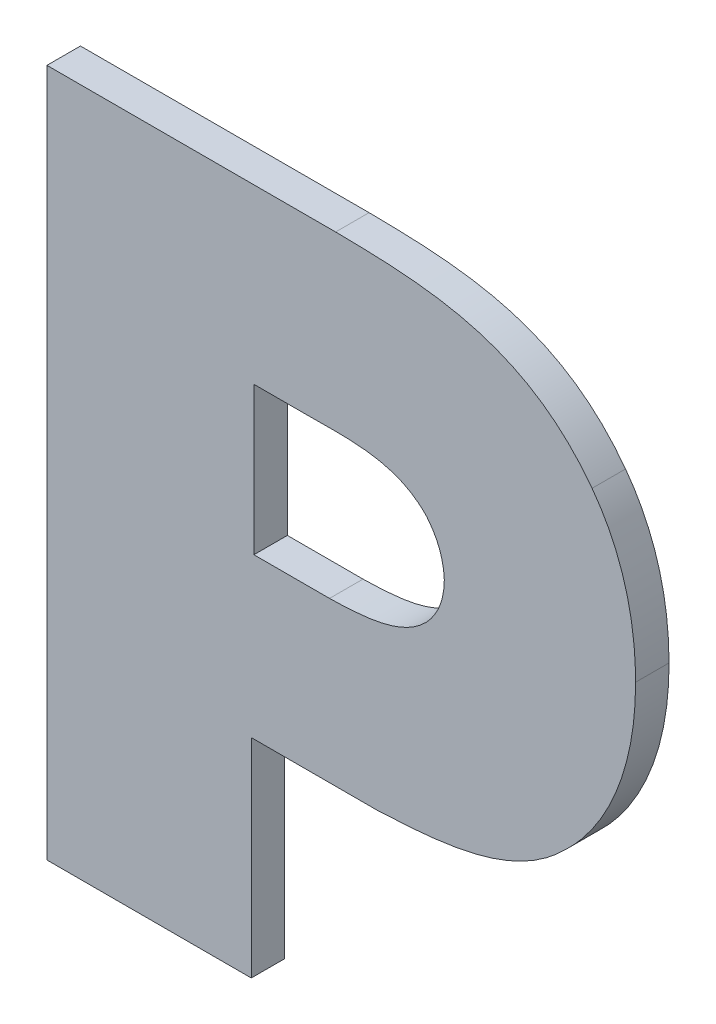
ISO-10303-21;
HEADER;
FILE_DESCRIPTION(('STEP AP214'),'2;1');
FILE_NAME('part.step','',(''),(''),'','','');
FILE_SCHEMA(('AUTOMOTIVE_DESIGN { 1 0 10303 214 1 1 1 1 }'));
ENDSEC;
DATA;
#1=APPLICATION_CONTEXT('core data for automotive mechanical design processes');
#2=APPLICATION_PROTOCOL_DEFINITION('international standard','automotive_design',2000,#1);
#3=PRODUCT_CONTEXT('',#1,'mechanical');
#4=PRODUCT('Part','Part','',(#3));
#5=PRODUCT_RELATED_PRODUCT_CATEGORY('part','',(#4));
#6=PRODUCT_DEFINITION_FORMATION('','',#4);
#7=PRODUCT_DEFINITION_CONTEXT('part definition',#1,'design');
#8=PRODUCT_DEFINITION('design','',#6,#7);
#9=PRODUCT_DEFINITION_SHAPE('','',#8);
#10=(LENGTH_UNIT() NAMED_UNIT(*) SI_UNIT(.MILLI.,.METRE.));
#11=(NAMED_UNIT(*) PLANE_ANGLE_UNIT() SI_UNIT($,.RADIAN.));
#12=(NAMED_UNIT(*) SI_UNIT($,.STERADIAN.) SOLID_ANGLE_UNIT());
#13=UNCERTAINTY_MEASURE_WITH_UNIT(LENGTH_MEASURE(1.E-05),#10,'distance_accuracy_value','');
#14=(GEOMETRIC_REPRESENTATION_CONTEXT(3) GLOBAL_UNCERTAINTY_ASSIGNED_CONTEXT((#13)) GLOBAL_UNIT_ASSIGNED_CONTEXT((#10,
#11,#12)) REPRESENTATION_CONTEXT('',''));
#15=CARTESIAN_POINT('',(0.,0.,0.));
#16=DIRECTION('',(0.,0.,1.));
#17=DIRECTION('',(1.,0.,0.));
#18=AXIS2_PLACEMENT_3D('',#15,#16,#17);
#19=CARTESIAN_POINT('',(-0.0967378041936285,-0.174241422626017,0.));
#20=CARTESIAN_POINT('',(-0.0968257015815132,-0.171889093901459,0.));
#21=CARTESIAN_POINT('',(-0.0982965922124445,-0.170133986594017,0.));
#22=CARTESIAN_POINT('',(-0.0967378041936285,-0.174241422626017,0.003));
#23=CARTESIAN_POINT('',(-0.0968257015815132,-0.171889093901459,0.003));
#24=CARTESIAN_POINT('',(-0.0982965922124445,-0.170133986594017,0.003));
#25=(BOUNDED_SURFACE() B_SPLINE_SURFACE(1,2,((#19,#20,#21),(#22,#23,#24)),.UNSPECIFIED.,.F.,.F.,
.F.) B_SPLINE_SURFACE_WITH_KNOTS((2,2),(3,3),(0.,0.0605498423726523),(-3.28337692066341,
-3.03707587900119),
.UNSPECIFIED.) GEOMETRIC_REPRESENTATION_ITEM() RATIONAL_B_SPLINE_SURFACE(((1.,0.992426553478269,
1.),(1.,0.992426553478269,1.))) REPRESENTATION_ITEM('') SURFACE());
#26=CARTESIAN_POINT('',(-0.142651936646498,-0.191678351140562,0.));
#27=DIRECTION('',(0.,0.,-1.));
#28=DIRECTION('',(-0.915373470419152,-0.402605774490131,0.));
#29=AXIS2_PLACEMENT_3D('',#26,#27,#28);
#30=ELLIPSE('',#29,0.0495459588736265,0.0178614282231468);
#31=CARTESIAN_POINT('',(-0.0982965922124445,-0.170133986594017,0.));
#32=VERTEX_POINT('',#31);
#33=CARTESIAN_POINT('',(-0.0967378041936284,-0.174241422626017,0.));
#34=VERTEX_POINT('',#33);
#35=EDGE_CURVE('E11',#32,#34,#30,.T.);
#36=DIRECTION('',(0.,0.,1.));
#37=VECTOR('',#36,1.);
#38=CARTESIAN_POINT('',(-0.0967378041936284,-0.174241422626017,0.));
#39=LINE('',#38,#37);
#40=CARTESIAN_POINT('',(-0.0967378041936284,-0.174241422626017,0.003));
#41=VERTEX_POINT('',#40);
#42=EDGE_CURVE('E26',#34,#41,#39,.T.);
#43=CARTESIAN_POINT('',(-0.142651936646498,-0.191678351140562,0.003));
#44=DIRECTION('',(0.,0.,-1.));
#45=DIRECTION('',(-0.915373470419152,-0.402605774490131,0.));
#46=AXIS2_PLACEMENT_3D('',#43,#44,#45);
#47=ELLIPSE('',#46,0.0495459588736265,0.0178614282231468);
#48=CARTESIAN_POINT('',(-0.0982965922124445,-0.170133986594017,0.003));
#49=VERTEX_POINT('',#48);
#50=EDGE_CURVE('E424',#49,#41,#47,.T.);
#51=DIRECTION('',(0.,0.,1.));
#52=VECTOR('',#51,1.);
#53=CARTESIAN_POINT('',(-0.0982965922124445,-0.170133986594017,0.));
#54=LINE('',#53,#52);
#55=EDGE_CURVE('E418',#32,#49,#54,.T.);
#56=ORIENTED_EDGE('',*,*,#35,.T.);
#57=ORIENTED_EDGE('',*,*,#42,.T.);
#58=ORIENTED_EDGE('',*,*,#50,.F.);
#59=ORIENTED_EDGE('',*,*,#55,.F.);
#60=EDGE_LOOP('',(#56,#57,#58,#59));
#61=FACE_BOUND('',#60,.T.);
#62=ADVANCED_FACE('F17',(#61),#25,.T.);
#63=CARTESIAN_POINT('',(-0.108740550557404,-0.16758533323252,0.));
#64=CARTESIAN_POINT('',(-0.108740550557404,-0.16758533323252,0.003));
#65=CARTESIAN_POINT('',(-0.105233258695452,-0.167585358431592,0.));
#66=CARTESIAN_POINT('',(-0.105233258695452,-0.167585358431592,0.003));
#67=CARTESIAN_POINT('',(-0.1009465620805,-0.167258010157494,0.));
#68=CARTESIAN_POINT('',(-0.1009465620805,-0.167258010157494,0.003));
#69=CARTESIAN_POINT('',(-0.0982965922124445,-0.170133986594017,0.));
#70=CARTESIAN_POINT('',(-0.0982965922124445,-0.170133986594017,0.003));
#71=B_SPLINE_SURFACE_WITH_KNOTS('',3,1,((#63,#64),(#65,#66),(#67,#68),(#69,#70)),.UNSPECIFIED.,
.F.,.F.,.F.,(4,4),(2,2),(0.,1.),(0.,0.0003),.UNSPECIFIED.);
#72=CARTESIAN_POINT('',(-0.108740550557404,-0.16758533323252,0.));
#73=CARTESIAN_POINT('',(-0.105233258695452,-0.167585358431592,0.));
#74=CARTESIAN_POINT('',(-0.1009465620805,-0.167258010157494,0.));
#75=CARTESIAN_POINT('',(-0.0982965922124445,-0.170133986594017,0.));
#76=B_SPLINE_CURVE_WITH_KNOTS('',3,(#72,#73,#74,#75),.UNSPECIFIED.,.F.,.F.,(4,4),(0.,1.),.UNSPECIFIED.);
#77=CARTESIAN_POINT('',(-0.108740550557404,-0.16758533323252,0.));
#78=VERTEX_POINT('',#77);
#79=EDGE_CURVE('E410',#78,#32,#76,.T.);
#80=CARTESIAN_POINT('',(-0.108740550557404,-0.16758533323252,0.003));
#81=CARTESIAN_POINT('',(-0.105233258695452,-0.167585358431592,0.003));
#82=CARTESIAN_POINT('',(-0.1009465620805,-0.167258010157494,0.003));
#83=CARTESIAN_POINT('',(-0.0982965922124445,-0.170133986594017,0.003));
#84=B_SPLINE_CURVE_WITH_KNOTS('',3,(#80,#81,#82,#83),.UNSPECIFIED.,.F.,.F.,(4,4),(0.,1.),.UNSPECIFIED.);
#85=CARTESIAN_POINT('',(-0.108740550557404,-0.16758533323252,0.003));
#86=VERTEX_POINT('',#85);
#87=EDGE_CURVE('E405',#86,#49,#84,.T.);
#88=DIRECTION('',(0.,0.,1.));
#89=VECTOR('',#88,1.);
#90=CARTESIAN_POINT('',(-0.108740550557404,-0.16758533323252,0.));
#91=LINE('',#90,#89);
#92=EDGE_CURVE('E402',#78,#86,#91,.T.);
#93=ORIENTED_EDGE('',*,*,#79,.T.);
#94=ORIENTED_EDGE('',*,*,#55,.T.);
#95=ORIENTED_EDGE('',*,*,#87,.F.);
#96=ORIENTED_EDGE('',*,*,#92,.F.);
#97=EDGE_LOOP('',(#93,#94,#95,#96));
#98=FACE_BOUND('',#97,.T.);
#99=ADVANCED_FACE('F443',(#98),#71,.T.);
#100=CARTESIAN_POINT('',(-0.113806661089584,-0.16758533323252,0.));
#101=DIRECTION('',(0.,-1.,0.));
#102=DIRECTION('',(1.,0.,0.));
#103=AXIS2_PLACEMENT_3D('',#100,#101,#102);
#104=PLANE('',#103);
#105=DIRECTION('',(1.,0.,0.));
#106=VECTOR('',#105,1.);
#107=CARTESIAN_POINT('',(-0.113806661089584,-0.16758533323252,0.));
#108=LINE('',#107,#106);
#109=CARTESIAN_POINT('',(-0.113806661089584,-0.16758533323252,0.));
#110=VERTEX_POINT('',#109);
#111=EDGE_CURVE('E399',#110,#78,#108,.T.);
#112=ORIENTED_EDGE('',*,*,#111,.T.);
#113=ORIENTED_EDGE('',*,*,#92,.T.);
#114=DIRECTION('',(1.,0.,0.));
#115=VECTOR('',#114,1.);
#116=CARTESIAN_POINT('',(-0.113806661089584,-0.16758533323252,0.003));
#117=LINE('',#116,#115);
#118=CARTESIAN_POINT('',(-0.113806661089584,-0.16758533323252,0.003));
#119=VERTEX_POINT('',#118);
#120=EDGE_CURVE('E396',#119,#86,#117,.T.);
#121=ORIENTED_EDGE('',*,*,#120,.F.);
#122=DIRECTION('',(0.,0.,1.));
#123=VECTOR('',#122,1.);
#124=CARTESIAN_POINT('',(-0.113806661089584,-0.16758533323252,0.));
#125=LINE('',#124,#123);
#126=EDGE_CURVE('E393',#110,#119,#125,.T.);
#127=ORIENTED_EDGE('',*,*,#126,.F.);
#128=EDGE_LOOP('',(#112,#113,#121,#127));
#129=FACE_BOUND('',#128,.T.);
#130=ADVANCED_FACE('F440',(#129),#104,.T.);
#131=CARTESIAN_POINT('',(-0.113806661089584,-0.180819534913461,0.));
#132=DIRECTION('',(1.,0.,0.));
#133=DIRECTION('',(0.,1.,0.));
#134=AXIS2_PLACEMENT_3D('',#131,#132,#133);
#135=PLANE('',#134);
#136=DIRECTION('',(0.,1.,0.));
#137=VECTOR('',#136,1.);
#138=CARTESIAN_POINT('',(-0.113806661089584,-0.180819534913461,0.));
#139=LINE('',#138,#137);
#140=CARTESIAN_POINT('',(-0.113806661089584,-0.180819534913461,0.));
#141=VERTEX_POINT('',#140);
#142=EDGE_CURVE('E390',#141,#110,#139,.T.);
#143=ORIENTED_EDGE('',*,*,#142,.T.);
#144=ORIENTED_EDGE('',*,*,#126,.T.);
#145=DIRECTION('',(0.,1.,0.));
#146=VECTOR('',#145,1.);
#147=CARTESIAN_POINT('',(-0.113806661089584,-0.180819534913461,0.003));
#148=LINE('',#147,#146);
#149=CARTESIAN_POINT('',(-0.113806661089584,-0.180819534913461,0.003));
#150=VERTEX_POINT('',#149);
#151=EDGE_CURVE('E387',#150,#119,#148,.T.);
#152=ORIENTED_EDGE('',*,*,#151,.F.);
#153=DIRECTION('',(0.,0.,1.));
#154=VECTOR('',#153,1.);
#155=CARTESIAN_POINT('',(-0.113806661089584,-0.180819534913461,0.));
#156=LINE('',#155,#154);
#157=EDGE_CURVE('E384',#141,#150,#156,.T.);
#158=ORIENTED_EDGE('',*,*,#157,.F.);
#159=EDGE_LOOP('',(#143,#144,#152,#158));
#160=FACE_BOUND('',#159,.T.);
#161=ADVANCED_FACE('F437',(#160),#135,.T.);
#162=CARTESIAN_POINT('',(-0.107025872505436,-0.180819534913461,0.));
#163=DIRECTION('',(0.,1.,0.));
#164=DIRECTION('',(-1.,0.,0.));
#165=AXIS2_PLACEMENT_3D('',#162,#163,#164);
#166=PLANE('',#165);
#167=DIRECTION('',(-1.,0.,0.));
#168=VECTOR('',#167,1.);
#169=CARTESIAN_POINT('',(-0.107025872505436,-0.180819534913461,0.));
#170=LINE('',#169,#168);
#171=CARTESIAN_POINT('',(-0.107025872505436,-0.180819534913461,0.));
#172=VERTEX_POINT('',#171);
#173=EDGE_CURVE('E381',#172,#141,#170,.T.);
#174=ORIENTED_EDGE('',*,*,#173,.T.);
#175=ORIENTED_EDGE('',*,*,#157,.T.);
#176=DIRECTION('',(-1.,0.,0.));
#177=VECTOR('',#176,1.);
#178=CARTESIAN_POINT('',(-0.107025872505436,-0.180819534913461,0.003));
#179=LINE('',#178,#177);
#180=CARTESIAN_POINT('',(-0.107025872505436,-0.180819534913461,0.003));
#181=VERTEX_POINT('',#180);
#182=EDGE_CURVE('E378',#181,#150,#179,.T.);
#183=ORIENTED_EDGE('',*,*,#182,.F.);
#184=DIRECTION('',(0.,0.,1.));
#185=VECTOR('',#184,1.);
#186=CARTESIAN_POINT('',(-0.107025872505436,-0.180819534913461,0.));
#187=LINE('',#186,#185);
#188=EDGE_CURVE('E372',#172,#181,#187,.T.);
#189=ORIENTED_EDGE('',*,*,#188,.F.);
#190=EDGE_LOOP('',(#174,#175,#183,#189));
#191=FACE_BOUND('',#190,.T.);
#192=ADVANCED_FACE('F434',(#191),#166,.T.);
#193=CARTESIAN_POINT('',(-0.0983745372290203,-0.178356645672117,0.));
#194=CARTESIAN_POINT('',(-0.0983745372290203,-0.178356645672117,0.003));
#195=CARTESIAN_POINT('',(-0.100556863987455,-0.180577928894314,0.));
#196=CARTESIAN_POINT('',(-0.100556863987455,-0.180577928894314,0.003));
#197=CARTESIAN_POINT('',(-0.103986225439683,-0.180741605941563,0.));
#198=CARTESIAN_POINT('',(-0.103986225439683,-0.180741605941563,0.003));
#199=CARTESIAN_POINT('',(-0.107025872505436,-0.180819534913461,0.));
#200=CARTESIAN_POINT('',(-0.107025872505436,-0.180819534913461,0.003));
#201=B_SPLINE_SURFACE_WITH_KNOTS('',3,1,((#193,#194),(#195,#196),(#197,#198),(#199,#200)),
.UNSPECIFIED.,.F.,.F.,.F.,(4,4),(2,2),(0.,1.),(0.,0.0003),.UNSPECIFIED.);
#202=CARTESIAN_POINT('',(-0.0983745372290203,-0.178356645672117,0.));
#203=CARTESIAN_POINT('',(-0.100556863987455,-0.180577928894314,0.));
#204=CARTESIAN_POINT('',(-0.103986225439683,-0.180741605941563,0.));
#205=CARTESIAN_POINT('',(-0.107025872505436,-0.180819534913461,0.));
#206=B_SPLINE_CURVE_WITH_KNOTS('',3,(#202,#203,#204,#205),.UNSPECIFIED.,.F.,.F.,(4,4),(0.,1.),.UNSPECIFIED.);
#207=CARTESIAN_POINT('',(-0.0983745372290203,-0.178356645672117,0.));
#208=VERTEX_POINT('',#207);
#209=EDGE_CURVE('E364',#208,#172,#206,.T.);
#210=CARTESIAN_POINT('',(-0.0983745372290203,-0.178356645672117,0.003));
#211=CARTESIAN_POINT('',(-0.100556863987455,-0.180577928894314,0.003));
#212=CARTESIAN_POINT('',(-0.103986225439683,-0.180741605941563,0.003));
#213=CARTESIAN_POINT('',(-0.107025872505436,-0.180819534913461,0.003));
#214=B_SPLINE_CURVE_WITH_KNOTS('',3,(#210,#211,#212,#213),.UNSPECIFIED.,.F.,.F.,(4,4),(0.,1.),.UNSPECIFIED.);
#215=CARTESIAN_POINT('',(-0.0983745372290203,-0.178356645672117,0.003));
#216=VERTEX_POINT('',#215);
#217=EDGE_CURVE('E359',#216,#181,#214,.T.);
#218=DIRECTION('',(0.,0.,1.));
#219=VECTOR('',#218,1.);
#220=CARTESIAN_POINT('',(-0.0983745372290203,-0.178356645672117,0.));
#221=LINE('',#220,#219);
#222=EDGE_CURVE('E356',#208,#216,#221,.T.);
#223=ORIENTED_EDGE('',*,*,#209,.T.);
#224=ORIENTED_EDGE('',*,*,#188,.T.);
#225=ORIENTED_EDGE('',*,*,#217,.F.);
#226=ORIENTED_EDGE('',*,*,#222,.F.);
#227=EDGE_LOOP('',(#223,#224,#225,#226));
#228=FACE_BOUND('',#227,.T.);
#229=ADVANCED_FACE('F431',(#228),#201,.T.);
#230=CARTESIAN_POINT('',(-0.0983745372290204,-0.178356645672117,0.));
#231=CARTESIAN_POINT('',(-0.096737469001351,-0.176642684990442,0.));
#232=CARTESIAN_POINT('',(-0.0967378041936284,-0.174241422626017,0.));
#233=CARTESIAN_POINT('',(-0.0983745372290204,-0.178356645672117,0.003));
#234=CARTESIAN_POINT('',(-0.096737469001351,-0.176642684990442,0.003));
#235=CARTESIAN_POINT('',(-0.0967378041936284,-0.174241422626017,0.003));
#236=(BOUNDED_SURFACE() B_SPLINE_SURFACE(1,2,((#230,#231,#232),(#233,#234,#235)),.UNSPECIFIED.,
.F.,.F.,.F.) B_SPLINE_SURFACE_WITH_KNOTS((2,2),(3,3),(0.,0.131295742859842),(-3.32565261163516,
-2.93267418086353),
.UNSPECIFIED.) GEOMETRIC_REPRESENTATION_ITEM() RATIONAL_B_SPLINE_SURFACE(((1.,0.980758021685967,
1.),(1.,0.980758021685967,1.))) REPRESENTATION_ITEM('') SURFACE());
#237=CARTESIAN_POINT('',(-0.118217977262407,-0.167626220694398,0.));
#238=DIRECTION('',(0.,0.,-1.));
#239=DIRECTION('',(-0.919658977595631,0.392717920303822,0.));
#240=AXIS2_PLACEMENT_3D('',#237,#238,#239);
#241=ELLIPSE('',#240,0.0228491795290156,0.011339904751575);
#242=EDGE_CURVE('E353',#34,#208,#241,.T.);
#243=CARTESIAN_POINT('',(-0.118217977262407,-0.167626220694398,0.003));
#244=DIRECTION('',(0.,0.,-1.));
#245=DIRECTION('',(-0.919658977595631,0.392717920303822,0.));
#246=AXIS2_PLACEMENT_3D('',#243,#244,#245);
#247=ELLIPSE('',#246,0.0228491795290156,0.011339904751575);
#248=EDGE_CURVE('E350',#41,#216,#247,.T.);
#249=ORIENTED_EDGE('',*,*,#242,.T.);
#250=ORIENTED_EDGE('',*,*,#222,.T.);
#251=ORIENTED_EDGE('',*,*,#248,.F.);
#252=ORIENTED_EDGE('',*,*,#42,.F.);
#253=EDGE_LOOP('',(#249,#250,#251,#252));
#254=FACE_BOUND('',#253,.T.);
#255=ADVANCED_FACE('F428',(#254),#236,.T.);
#256=CARTESIAN_POINT('',(-0.13235635029142,-0.213795935346145,0.));
#257=DIRECTION('',(0.,-1.,0.));
#258=DIRECTION('',(1.,0.,0.));
#259=AXIS2_PLACEMENT_3D('',#256,#257,#258);
#260=PLANE('',#259);
#261=DIRECTION('',(1.,0.,0.));
#262=VECTOR('',#261,1.);
#263=CARTESIAN_POINT('',(-0.13235635029142,-0.213795935346145,0.));
#264=LINE('',#263,#262);
#265=CARTESIAN_POINT('',(-0.13235635029142,-0.213795935346145,0.));
#266=VERTEX_POINT('',#265);
#267=CARTESIAN_POINT('',(-0.114040469398147,-0.213795935346145,0.));
#268=VERTEX_POINT('',#267);
#269=EDGE_CURVE('E348',#266,#268,#264,.T.);
#270=ORIENTED_EDGE('',*,*,#269,.T.);
#271=DIRECTION('',(0.,0.,1.));
#272=VECTOR('',#271,1.);
#273=CARTESIAN_POINT('',(-0.114040469398147,-0.213795935346145,0.));
#274=LINE('',#273,#272);
#275=CARTESIAN_POINT('',(-0.114040469398147,-0.213795935346145,0.003));
#276=VERTEX_POINT('',#275);
#277=EDGE_CURVE('E346',#268,#276,#274,.T.);
#278=ORIENTED_EDGE('',*,*,#277,.T.);
#279=DIRECTION('',(1.,0.,0.));
#280=VECTOR('',#279,1.);
#281=CARTESIAN_POINT('',(-0.13235635029142,-0.213795935346145,0.003));
#282=LINE('',#281,#280);
#283=CARTESIAN_POINT('',(-0.13235635029142,-0.213795935346145,0.003));
#284=VERTEX_POINT('',#283);
#285=EDGE_CURVE('E153',#284,#276,#282,.T.);
#286=ORIENTED_EDGE('',*,*,#285,.F.);
#287=DIRECTION('',(0.,0.,1.));
#288=VECTOR('',#287,1.);
#289=CARTESIAN_POINT('',(-0.13235635029142,-0.213795935346145,0.));
#290=LINE('',#289,#288);
#291=EDGE_CURVE('E342',#266,#284,#290,.T.);
#292=ORIENTED_EDGE('',*,*,#291,.F.);
#293=EDGE_LOOP('',(#270,#278,#286,#292));
#294=FACE_BOUND('',#293,.T.);
#295=ADVANCED_FACE('F481',(#294),#260,.T.);
#296=CARTESIAN_POINT('',(-0.13235635029142,-0.152098684228321,0.));
#297=DIRECTION('',(-1.,0.,0.));
#298=DIRECTION('',(0.,-1.,0.));
#299=AXIS2_PLACEMENT_3D('',#296,#297,#298);
#300=PLANE('',#299);
#301=DIRECTION('',(0.,-1.,0.));
#302=VECTOR('',#301,1.);
#303=CARTESIAN_POINT('',(-0.13235635029142,-0.152098684228321,0.));
#304=LINE('',#303,#302);
#305=CARTESIAN_POINT('',(-0.13235635029142,-0.152098684228321,0.));
#306=VERTEX_POINT('',#305);
#307=EDGE_CURVE('E339',#306,#266,#304,.T.);
#308=ORIENTED_EDGE('',*,*,#307,.T.);
#309=ORIENTED_EDGE('',*,*,#291,.T.);
#310=DIRECTION('',(0.,-1.,0.));
#311=VECTOR('',#310,1.);
#312=CARTESIAN_POINT('',(-0.13235635029142,-0.152098684228321,0.003));
#313=LINE('',#312,#311);
#314=CARTESIAN_POINT('',(-0.13235635029142,-0.152098684228321,0.003));
#315=VERTEX_POINT('',#314);
#316=EDGE_CURVE('E337',#315,#284,#313,.T.);
#317=ORIENTED_EDGE('',*,*,#316,.F.);
#318=DIRECTION('',(0.,0.,1.));
#319=VECTOR('',#318,1.);
#320=CARTESIAN_POINT('',(-0.13235635029142,-0.152098684228321,0.));
#321=LINE('',#320,#319);
#322=EDGE_CURVE('E334',#306,#315,#321,.T.);
#323=ORIENTED_EDGE('',*,*,#322,.F.);
#324=EDGE_LOOP('',(#308,#309,#317,#323));
#325=FACE_BOUND('',#324,.T.);
#326=ADVANCED_FACE('F489',(#325),#300,.T.);
#327=CARTESIAN_POINT('',(-0.106480294826928,-0.152098684228321,0.));
#328=DIRECTION('',(0.,1.,0.));
#329=DIRECTION('',(-1.,0.,0.));
#330=AXIS2_PLACEMENT_3D('',#327,#328,#329);
#331=PLANE('',#330);
#332=DIRECTION('',(-1.,0.,0.));
#333=VECTOR('',#332,1.);
#334=CARTESIAN_POINT('',(-0.106480294826928,-0.152098684228321,0.));
#335=LINE('',#334,#333);
#336=CARTESIAN_POINT('',(-0.106480294826928,-0.152098684228321,0.));
#337=VERTEX_POINT('',#336);
#338=EDGE_CURVE('E331',#337,#306,#335,.T.);
#339=ORIENTED_EDGE('',*,*,#338,.T.);
#340=ORIENTED_EDGE('',*,*,#322,.T.);
#341=DIRECTION('',(-1.,0.,0.));
#342=VECTOR('',#341,1.);
#343=CARTESIAN_POINT('',(-0.106480294826928,-0.152098684228321,0.003));
#344=LINE('',#343,#342);
#345=CARTESIAN_POINT('',(-0.106480294826928,-0.152098684228321,0.003));
#346=VERTEX_POINT('',#345);
#347=EDGE_CURVE('E328',#346,#315,#344,.T.);
#348=ORIENTED_EDGE('',*,*,#347,.F.);
#349=DIRECTION('',(0.,0.,1.));
#350=VECTOR('',#349,1.);
#351=CARTESIAN_POINT('',(-0.106480294826928,-0.152098684228321,0.));
#352=LINE('',#351,#350);
#353=EDGE_CURVE('E325',#337,#346,#352,.T.);
#354=ORIENTED_EDGE('',*,*,#353,.F.);
#355=EDGE_LOOP('',(#339,#340,#348,#354));
#356=FACE_BOUND('',#355,.T.);
#357=ADVANCED_FACE('F493',(#356),#331,.T.);
#358=CARTESIAN_POINT('',(-0.0834880070915036,-0.160500599730184,0.));
#359=CARTESIAN_POINT('',(-0.0834880070915036,-0.160500599730184,0.003));
#360=CARTESIAN_POINT('',(-0.0893335196636609,-0.152652049176437,0.));
#361=CARTESIAN_POINT('',(-0.0893335196636609,-0.152652049176437,0.003));
#362=CARTESIAN_POINT('',(-0.097751030579984,-0.152192198055002,0.));
#363=CARTESIAN_POINT('',(-0.097751030579984,-0.152192198055002,0.003));
#364=CARTESIAN_POINT('',(-0.106480294826928,-0.152098684228321,0.));
#365=CARTESIAN_POINT('',(-0.106480294826928,-0.152098684228321,0.003));
#366=B_SPLINE_SURFACE_WITH_KNOTS('',3,1,((#358,#359),(#360,#361),(#362,#363),(#364,#365)),
.UNSPECIFIED.,.F.,.F.,.F.,(4,4),(2,2),(0.,1.),(0.,0.0003),.UNSPECIFIED.);
#367=CARTESIAN_POINT('',(-0.0834880070915036,-0.160500599730184,0.));
#368=CARTESIAN_POINT('',(-0.0893335196636609,-0.152652049176437,0.));
#369=CARTESIAN_POINT('',(-0.097751030579984,-0.152192198055002,0.));
#370=CARTESIAN_POINT('',(-0.106480294826928,-0.152098684228321,0.));
#371=B_SPLINE_CURVE_WITH_KNOTS('',3,(#367,#368,#369,#370),.UNSPECIFIED.,.F.,.F.,(4,4),(0.,1.),.UNSPECIFIED.);
#372=CARTESIAN_POINT('',(-0.0834880070915036,-0.160500599730184,0.));
#373=VERTEX_POINT('',#372);
#374=EDGE_CURVE('E291',#373,#337,#371,.T.);
#375=CARTESIAN_POINT('',(-0.0834880070915036,-0.160500599730184,0.003));
#376=CARTESIAN_POINT('',(-0.0893335196636609,-0.152652049176437,0.003));
#377=CARTESIAN_POINT('',(-0.097751030579984,-0.152192198055002,0.003));
#378=CARTESIAN_POINT('',(-0.106480294826928,-0.152098684228321,0.003));
#379=B_SPLINE_CURVE_WITH_KNOTS('',3,(#375,#376,#377,#378),.UNSPECIFIED.,.F.,.F.,(4,4),(0.,1.),.UNSPECIFIED.);
#380=CARTESIAN_POINT('',(-0.0834880070915036,-0.160500599730184,0.003));
#381=VERTEX_POINT('',#380);
#382=EDGE_CURVE('E308',#381,#346,#379,.T.);
#383=DIRECTION('',(0.,0.,1.));
#384=VECTOR('',#383,1.);
#385=CARTESIAN_POINT('',(-0.0834880070915036,-0.160500599730184,0.));
#386=LINE('',#385,#384);
#387=EDGE_CURVE('E293',#373,#381,#386,.T.);
#388=ORIENTED_EDGE('',*,*,#374,.T.);
#389=ORIENTED_EDGE('',*,*,#353,.T.);
#390=ORIENTED_EDGE('',*,*,#382,.F.);
#391=ORIENTED_EDGE('',*,*,#387,.F.);
#392=EDGE_LOOP('',(#388,#389,#390,#391));
#393=FACE_BOUND('',#392,.T.);
#394=ADVANCED_FACE('F496',(#393),#366,.T.);
#395=CARTESIAN_POINT('',(-0.0795910290221276,-0.173610102220341,0.));
#396=CARTESIAN_POINT('',(-0.0795911810120428,-0.165755607112078,0.));
#397=CARTESIAN_POINT('',(-0.0834880070915036,-0.160500599730184,0.));
#398=CARTESIAN_POINT('',(-0.0795910290221276,-0.173610102220341,0.003));
#399=CARTESIAN_POINT('',(-0.0795911810120428,-0.165755607112078,0.003));
#400=CARTESIAN_POINT('',(-0.0834880070915036,-0.160500599730184,0.003));
#401=(BOUNDED_SURFACE() B_SPLINE_SURFACE(1,2,((#395,#396,#397),(#398,#399,#400)),.UNSPECIFIED.,
.F.,.F.,.F.) B_SPLINE_SURFACE_WITH_KNOTS((2,2),(3,3),(0.,0.0287431762030417),
(-0.306992221891992,-0.0064354486976359),
.UNSPECIFIED.) GEOMETRIC_REPRESENTATION_ITEM() RATIONAL_B_SPLINE_SURFACE(((1.,0.988729438048959,
1.),(1.,0.988729438048959,1.))) REPRESENTATION_ITEM('') SURFACE());
#402=CARTESIAN_POINT('',(-0.0795910290221276,-0.173610102220341,0.));
#403=CARTESIAN_POINT('',(-0.0795910378746284,-0.173289206997902,0.));
#404=CARTESIAN_POINT('',(-0.0795960316046132,-0.172968292037768,0.));
#405=CARTESIAN_POINT('',(-0.0796163790223154,-0.17233205838337,0.));
#406=CARTESIAN_POINT('',(-0.0796315616039234,-0.172016734157963,0.));
#407=CARTESIAN_POINT('',(-0.0796723122289031,-0.171391862234799,0.));
#408=CARTESIAN_POINT('',(-0.0796977086244951,-0.171082303474623,0.));
#409=CARTESIAN_POINT('',(-0.0797589042115397,-0.17046915253469,0.));
#410=CARTESIAN_POINT('',(-0.0797945326072473,-0.170165543392426,0.));
#411=CARTESIAN_POINT('',(-0.0798761961675504,-0.169564472292133,0.));
#412=CARTESIAN_POINT('',(-0.0799220630158278,-0.169266987561039,0.));
#413=CARTESIAN_POINT('',(-0.0800241951768409,-0.168678340841473,0.));
#414=CARTESIAN_POINT('',(-0.0800802963898668,-0.168387150470413,0.));
#415=CARTESIAN_POINT('',(-0.0802028762106454,-0.167811261185297,0.));
#416=CARTESIAN_POINT('',(-0.0802691967716995,-0.167526528716167,0.));
#417=CARTESIAN_POINT('',(-0.0804121814596128,-0.166963716911774,0.));
#418=CARTESIAN_POINT('',(-0.0804886954739031,-0.166685599519141,0.));
#419=CARTESIAN_POINT('',(-0.080652020460211,-0.166136171888199,0.));
#420=CARTESIAN_POINT('',(-0.0807386911217503,-0.165864820012281,0.));
#421=CARTESIAN_POINT('',(-0.0809222701041933,-0.165329069271403,0.));
#422=CARTESIAN_POINT('',(-0.0810190497022285,-0.165064626361013,0.));
#423=CARTESIAN_POINT('',(-0.0812227748018691,-0.164542830754143,0.));
#424=CARTESIAN_POINT('',(-0.0813296047955142,-0.164285433011895,0.));
#425=CARTESIAN_POINT('',(-0.0815533466337949,-0.16377785575727,0.));
#426=CARTESIAN_POINT('',(-0.0816701575793477,-0.163527631809478,0.));
#427=CARTESIAN_POINT('',(-0.0819137659063232,-0.163034520827849,0.));
#428=CARTESIAN_POINT('',(-0.0820404780795577,-0.162791591729548,0.));
#429=CARTESIAN_POINT('',(-0.0823037806606822,-0.162313178507681,0.));
#430=CARTESIAN_POINT('',(-0.0824403022779158,-0.162077656543779,0.));
#431=CARTESIAN_POINT('',(-0.0827231104958188,-0.161614158348455,0.));
#432=CARTESIAN_POINT('',(-0.0828693449932229,-0.161386150339278,0.));
#433=CARTESIAN_POINT('',(-0.0831714349089739,-0.160937760220683,0.));
#434=CARTESIAN_POINT('',(-0.0833272548607435,-0.160717354212594,0.));
#435=CARTESIAN_POINT('',(-0.0834880070915036,-0.160500599730184,0.));
#436=B_SPLINE_CURVE_WITH_KNOTS('',3,(#402,#403,#404,#405,#406,#407,#408,#409,#410,#411,#412,
#413,#414,#415,#416,#417,#418,#419,#420,#421,#422,#423,#424,#425,#426,#427,#428,#429,#430,#431,
#432,#433,#434,#435),.UNSPECIFIED.,.F.,.F.,(4,2,2,2,2,2,2,2,2,2,2,2,2,2,2,2,4),(0.,
0.000962675939883551,0.0019095768295927,0.00284118852499832,0.00375807313893125,
0.00466086941839039,0.00555029235204594,0.00642713189596271,0.0072922507122064,
0.00814658082930227,0.00899111915643842,0.00982692181526395,0.0106550972936832,
0.0114767984736574,0.0122932136370127,0.0131055566058743,0.0139150562231228),.UNSPECIFIED.);
#437=CARTESIAN_POINT('',(-0.0795910290221276,-0.173610102220341,0.));
#438=VERTEX_POINT('',#437);
#439=EDGE_CURVE('E286',#438,#373,#436,.T.);
#440=CARTESIAN_POINT('',(-0.0834880070915036,-0.160500599730184,0.003));
#441=CARTESIAN_POINT('',(-0.0795911810120428,-0.165755607112078,0.003));
#442=CARTESIAN_POINT('',(-0.0795910290221276,-0.173610102220341,0.003));
#443=(BOUNDED_CURVE() B_SPLINE_CURVE(2,(#440,#441,#442),.UNSPECIFIED.,.F.,
.F.) B_SPLINE_CURVE_WITH_KNOTS((3,3),(-0.306992221891992,-0.0064354486976359),
.UNSPECIFIED.) CURVE() GEOMETRIC_REPRESENTATION_ITEM() RATIONAL_B_SPLINE_CURVE((1.,
0.988729438048959,1.)) REPRESENTATION_ITEM(''));
#444=CARTESIAN_POINT('',(-0.0795910290221276,-0.173610102220341,0.003));
#445=VERTEX_POINT('',#444);
#446=EDGE_CURVE('E236',#445,#381,#443,.F.);
#447=DIRECTION('',(0.,0.,1.));
#448=VECTOR('',#447,1.);
#449=CARTESIAN_POINT('',(-0.0795910290221276,-0.173610102220341,0.));
#450=LINE('',#449,#448);
#451=EDGE_CURVE('E234',#438,#445,#450,.T.);
#452=ORIENTED_EDGE('',*,*,#439,.T.);
#453=ORIENTED_EDGE('',*,*,#387,.T.);
#454=ORIENTED_EDGE('',*,*,#446,.F.);
#455=ORIENTED_EDGE('',*,*,#451,.F.);
#456=EDGE_LOOP('',(#452,#453,#454,#455));
#457=FACE_BOUND('',#456,.T.);
#458=ADVANCED_FACE('F202',(#457),#401,.F.);
#459=CARTESIAN_POINT('',(-0.0859041421586396,-0.189774841849129,0.));
#460=CARTESIAN_POINT('',(-0.079550477444554,-0.183759567175503,0.));
#461=CARTESIAN_POINT('',(-0.0795910290221276,-0.173610102220341,0.));
#462=CARTESIAN_POINT('',(-0.0859041421586396,-0.189774841849129,0.003));
#463=CARTESIAN_POINT('',(-0.079550477444554,-0.183759567175503,0.003));
#464=CARTESIAN_POINT('',(-0.0795910290221276,-0.173610102220341,0.003));
#465=(BOUNDED_SURFACE() B_SPLINE_SURFACE(1,2,((#459,#460,#461),(#462,#463,#464)),.UNSPECIFIED.,
.F.,.F.,.F.) B_SPLINE_SURFACE_WITH_KNOTS((2,2),(3,3),(0.,0.118644741901312),(0.272864371694586,
1.06550640205632),.UNSPECIFIED.) GEOMETRIC_REPRESENTATION_ITEM() RATIONAL_B_SPLINE_SURFACE(((1.,
0.922487421700011,1.),(1.,0.922487421700011,1.))) REPRESENTATION_ITEM('') SURFACE());
#466=CARTESIAN_POINT('',(-0.0859041421586396,-0.189774841849129,0.));
#467=CARTESIAN_POINT('',(-0.079550477444554,-0.183759567175503,0.));
#468=CARTESIAN_POINT('',(-0.0795910290221276,-0.173610102220341,0.));
#469=(BOUNDED_CURVE() B_SPLINE_CURVE(2,(#466,#467,#468),.UNSPECIFIED.,.F.,
.F.) B_SPLINE_CURVE_WITH_KNOTS((3,3),(0.272864371694586,1.06550640205632),
.UNSPECIFIED.) CURVE() GEOMETRIC_REPRESENTATION_ITEM() RATIONAL_B_SPLINE_CURVE((1.,
0.922487421700011,1.)) REPRESENTATION_ITEM(''));
#470=CARTESIAN_POINT('',(-0.0859041421586396,-0.189774841849129,0.));
#471=VERTEX_POINT('',#470);
#472=EDGE_CURVE('E231',#471,#438,#469,.T.);
#473=CARTESIAN_POINT('',(-0.0795910290221276,-0.173610102220341,0.003));
#474=CARTESIAN_POINT('',(-0.079550477444554,-0.183759567175503,0.003));
#475=CARTESIAN_POINT('',(-0.0859041421586396,-0.189774841849129,0.003));
#476=(BOUNDED_CURVE() B_SPLINE_CURVE(2,(#473,#474,#475),.UNSPECIFIED.,.F.,
.F.) B_SPLINE_CURVE_WITH_KNOTS((3,3),(0.272864371694586,1.06550640205632),
.UNSPECIFIED.) CURVE() GEOMETRIC_REPRESENTATION_ITEM() RATIONAL_B_SPLINE_CURVE((1.,
0.922487421700011,1.)) REPRESENTATION_ITEM(''));
#477=CARTESIAN_POINT('',(-0.0859041421586396,-0.189774841849129,0.003));
#478=VERTEX_POINT('',#477);
#479=EDGE_CURVE('E182',#478,#445,#476,.F.);
#480=DIRECTION('',(0.,0.,1.));
#481=VECTOR('',#480,1.);
#482=CARTESIAN_POINT('',(-0.0859041421586396,-0.189774841849129,0.));
#483=LINE('',#482,#481);
#484=EDGE_CURVE('E178',#471,#478,#483,.T.);
#485=ORIENTED_EDGE('',*,*,#472,.T.);
#486=ORIENTED_EDGE('',*,*,#451,.T.);
#487=ORIENTED_EDGE('',*,*,#479,.F.);
#488=ORIENTED_EDGE('',*,*,#484,.F.);
#489=EDGE_LOOP('',(#485,#486,#487,#488));
#490=FACE_BOUND('',#489,.T.);
#491=ADVANCED_FACE('F189',(#490),#465,.F.);
#492=CARTESIAN_POINT('',(-0.102739180049539,-0.195129312574761,0.));
#493=CARTESIAN_POINT('',(-0.102739180049539,-0.195129312574761,0.003));
#494=CARTESIAN_POINT('',(-0.0966598591770501,-0.194848734047269,0.));
#495=CARTESIAN_POINT('',(-0.0966598591770501,-0.194848734047269,0.003));
#496=CARTESIAN_POINT('',(-0.0905026093325373,-0.194381101385398,0.));
#497=CARTESIAN_POINT('',(-0.0905026093325373,-0.194381101385398,0.003));
#498=CARTESIAN_POINT('',(-0.0859041421586396,-0.189774841849129,0.));
#499=CARTESIAN_POINT('',(-0.0859041421586396,-0.189774841849129,0.003));
#500=B_SPLINE_SURFACE_WITH_KNOTS('',3,1,((#492,#493),(#494,#495),(#496,#497),(#498,#499)),
.UNSPECIFIED.,.F.,.F.,.F.,(4,4),(2,2),(0.,1.),(0.,0.0003),.UNSPECIFIED.);
#501=CARTESIAN_POINT('',(-0.102739180049539,-0.195129312574761,0.));
#502=CARTESIAN_POINT('',(-0.0966598591770501,-0.194848734047269,0.));
#503=CARTESIAN_POINT('',(-0.0905026093325373,-0.194381101385398,0.));
#504=CARTESIAN_POINT('',(-0.0859041421586396,-0.189774841849129,0.));
#505=B_SPLINE_CURVE_WITH_KNOTS('',3,(#501,#502,#503,#504),.UNSPECIFIED.,.F.,.F.,(4,4),(0.,1.),.UNSPECIFIED.);
#506=CARTESIAN_POINT('',(-0.102739180049539,-0.195129312574761,0.));
#507=VERTEX_POINT('',#506);
#508=EDGE_CURVE('E168',#507,#471,#505,.T.);
#509=CARTESIAN_POINT('',(-0.102739180049539,-0.195129312574761,0.003));
#510=CARTESIAN_POINT('',(-0.0966598591770501,-0.194848734047269,0.003));
#511=CARTESIAN_POINT('',(-0.0905026093325373,-0.194381101385398,0.003));
#512=CARTESIAN_POINT('',(-0.0859041421586396,-0.189774841849129,0.003));
#513=B_SPLINE_CURVE_WITH_KNOTS('',3,(#509,#510,#511,#512),.UNSPECIFIED.,.F.,.F.,(4,4),(0.,1.),.UNSPECIFIED.);
#514=CARTESIAN_POINT('',(-0.102739180049539,-0.195129312574761,0.003));
#515=VERTEX_POINT('',#514);
#516=EDGE_CURVE('E159',#515,#478,#513,.T.);
#517=DIRECTION('',(0.,0.,1.));
#518=VECTOR('',#517,1.);
#519=CARTESIAN_POINT('',(-0.102739180049539,-0.195129312574761,0.));
#520=LINE('',#519,#518);
#521=EDGE_CURVE('E135',#507,#515,#520,.T.);
#522=ORIENTED_EDGE('',*,*,#508,.T.);
#523=ORIENTED_EDGE('',*,*,#484,.T.);
#524=ORIENTED_EDGE('',*,*,#516,.F.);
#525=ORIENTED_EDGE('',*,*,#521,.F.);
#526=EDGE_LOOP('',(#522,#523,#524,#525));
#527=FACE_BOUND('',#526,.T.);
#528=ADVANCED_FACE('F201',(#527),#500,.T.);
#529=CARTESIAN_POINT('',(-0.114040469398147,-0.195129312574761,0.));
#530=DIRECTION('',(0.,-1.,0.));
#531=DIRECTION('',(1.,0.,0.));
#532=AXIS2_PLACEMENT_3D('',#529,#530,#531);
#533=PLANE('',#532);
#534=DIRECTION('',(1.,0.,0.));
#535=VECTOR('',#534,1.);
#536=CARTESIAN_POINT('',(-0.114040469398147,-0.195129312574761,0.));
#537=LINE('',#536,#535);
#538=CARTESIAN_POINT('',(-0.114040469398147,-0.195129312574761,0.));
#539=VERTEX_POINT('',#538);
#540=EDGE_CURVE('E139',#539,#507,#537,.T.);
#541=ORIENTED_EDGE('',*,*,#540,.T.);
#542=ORIENTED_EDGE('',*,*,#521,.T.);
#543=DIRECTION('',(1.,0.,0.));
#544=VECTOR('',#543,1.);
#545=CARTESIAN_POINT('',(-0.114040469398147,-0.195129312574761,0.003));
#546=LINE('',#545,#544);
#547=CARTESIAN_POINT('',(-0.114040469398147,-0.195129312574761,0.003));
#548=VERTEX_POINT('',#547);
#549=EDGE_CURVE('E128',#548,#515,#546,.T.);
#550=ORIENTED_EDGE('',*,*,#549,.F.);
#551=DIRECTION('',(0.,0.,1.));
#552=VECTOR('',#551,1.);
#553=CARTESIAN_POINT('',(-0.114040469398147,-0.195129312574761,0.));
#554=LINE('',#553,#552);
#555=EDGE_CURVE('E132',#539,#548,#554,.T.);
#556=ORIENTED_EDGE('',*,*,#555,.F.);
#557=EDGE_LOOP('',(#541,#542,#550,#556));
#558=FACE_BOUND('',#557,.T.);
#559=ADVANCED_FACE('F131',(#558),#533,.T.);
#560=CARTESIAN_POINT('',(-0.114040469398147,-0.213795935346145,0.));
#561=DIRECTION('',(1.,0.,0.));
#562=DIRECTION('',(0.,1.,0.));
#563=AXIS2_PLACEMENT_3D('',#560,#561,#562);
#564=PLANE('',#563);
#565=DIRECTION('',(0.,1.,0.));
#566=VECTOR('',#565,1.);
#567=CARTESIAN_POINT('',(-0.114040469398147,-0.213795935346145,0.));
#568=LINE('',#567,#566);
#569=EDGE_CURVE('E147',#268,#539,#568,.T.);
#570=ORIENTED_EDGE('',*,*,#569,.T.);
#571=ORIENTED_EDGE('',*,*,#555,.T.);
#572=DIRECTION('',(0.,1.,0.));
#573=VECTOR('',#572,1.);
#574=CARTESIAN_POINT('',(-0.114040469398147,-0.213795935346145,0.003));
#575=LINE('',#574,#573);
#576=EDGE_CURVE('E145',#276,#548,#575,.T.);
#577=ORIENTED_EDGE('',*,*,#576,.F.);
#578=ORIENTED_EDGE('',*,*,#277,.F.);
#579=EDGE_LOOP('',(#570,#571,#577,#578));
#580=FACE_BOUND('',#579,.T.);
#581=ADVANCED_FACE('F143',(#580),#564,.T.);
#582=CARTESIAN_POINT('',(-0.105973675854258,-0.182947309787233,0.003));
#583=DIRECTION('',(0.,0.,1.));
#584=DIRECTION('',(1.,0.,0.));
#585=AXIS2_PLACEMENT_3D('',#582,#583,#584);
#586=PLANE('',#585);
#587=ORIENTED_EDGE('',*,*,#576,.T.);
#588=ORIENTED_EDGE('',*,*,#549,.T.);
#589=ORIENTED_EDGE('',*,*,#516,.T.);
#590=ORIENTED_EDGE('',*,*,#479,.T.);
#591=ORIENTED_EDGE('',*,*,#446,.T.);
#592=ORIENTED_EDGE('',*,*,#382,.T.);
#593=ORIENTED_EDGE('',*,*,#347,.T.);
#594=ORIENTED_EDGE('',*,*,#316,.T.);
#595=ORIENTED_EDGE('',*,*,#285,.T.);
#596=EDGE_LOOP('',(#587,#588,#589,#590,#591,#592,#593,#594,#595));
#597=FACE_BOUND('',#596,.T.);
#598=ORIENTED_EDGE('',*,*,#248,.T.);
#599=ORIENTED_EDGE('',*,*,#217,.T.);
#600=ORIENTED_EDGE('',*,*,#182,.T.);
#601=ORIENTED_EDGE('',*,*,#151,.T.);
#602=ORIENTED_EDGE('',*,*,#120,.T.);
#603=ORIENTED_EDGE('',*,*,#87,.T.);
#604=ORIENTED_EDGE('',*,*,#50,.T.);
#605=EDGE_LOOP('',(#598,#599,#600,#601,#602,#603,#604));
#606=FACE_BOUND('',#605,.T.);
#607=ADVANCED_FACE('F150',(#597,#606),#586,.T.);
#608=CARTESIAN_POINT('',(-0.105973675854258,-0.182947309787233,0.));
#609=DIRECTION('',(0.,0.,1.));
#610=DIRECTION('',(1.,0.,0.));
#611=AXIS2_PLACEMENT_3D('',#608,#609,#610);
#612=PLANE('',#611);
#613=ORIENTED_EDGE('',*,*,#569,.F.);
#614=ORIENTED_EDGE('',*,*,#269,.F.);
#615=ORIENTED_EDGE('',*,*,#307,.F.);
#616=ORIENTED_EDGE('',*,*,#338,.F.);
#617=ORIENTED_EDGE('',*,*,#374,.F.);
#618=ORIENTED_EDGE('',*,*,#439,.F.);
#619=ORIENTED_EDGE('',*,*,#472,.F.);
#620=ORIENTED_EDGE('',*,*,#508,.F.);
#621=ORIENTED_EDGE('',*,*,#540,.F.);
#622=EDGE_LOOP('',(#613,#614,#615,#616,#617,#618,#619,#620,#621));
#623=FACE_BOUND('',#622,.T.);
#624=ORIENTED_EDGE('',*,*,#242,.F.);
#625=ORIENTED_EDGE('',*,*,#35,.F.);
#626=ORIENTED_EDGE('',*,*,#79,.F.);
#627=ORIENTED_EDGE('',*,*,#111,.F.);
#628=ORIENTED_EDGE('',*,*,#142,.F.);
#629=ORIENTED_EDGE('',*,*,#173,.F.);
#630=ORIENTED_EDGE('',*,*,#209,.F.);
#631=EDGE_LOOP('',(#624,#625,#626,#627,#628,#629,#630));
#632=FACE_BOUND('',#631,.T.);
#633=ADVANCED_FACE('F265',(#623,#632),#612,.F.);
#634=CLOSED_SHELL('',(#62,#99,#130,#161,#192,#229,#255,#295,#326,#357,#394,#458,#491,#528,#559,
#581,#607,#633));
#635=MANIFOLD_SOLID_BREP('B1',#634);
#636=ADVANCED_BREP_SHAPE_REPRESENTATION('',(#18,#635),#14);
#637=SHAPE_DEFINITION_REPRESENTATION(#9,#636);
ENDSEC;
END-ISO-10303-21;
